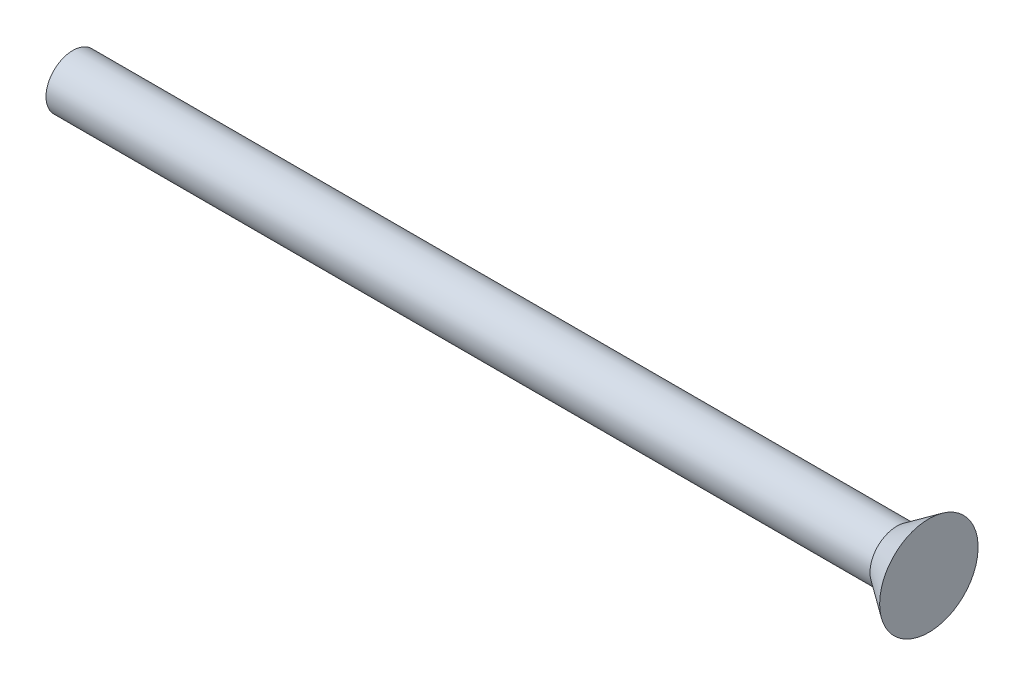
ISO-10303-21;
HEADER;
FILE_DESCRIPTION(('STEP AP214'),'2;1');
FILE_NAME('part.step','',(''),(''),'','','');
FILE_SCHEMA(('AUTOMOTIVE_DESIGN { 1 0 10303 214 1 1 1 1 }'));
ENDSEC;
DATA;
#1=APPLICATION_CONTEXT('core data for automotive mechanical design processes');
#2=APPLICATION_PROTOCOL_DEFINITION('international standard','automotive_design',2000,#1);
#3=PRODUCT_CONTEXT('',#1,'mechanical');
#4=PRODUCT('Part','Part','',(#3));
#5=PRODUCT_RELATED_PRODUCT_CATEGORY('part','',(#4));
#6=PRODUCT_DEFINITION_FORMATION('','',#4);
#7=PRODUCT_DEFINITION_CONTEXT('part definition',#1,'design');
#8=PRODUCT_DEFINITION('design','',#6,#7);
#9=PRODUCT_DEFINITION_SHAPE('','',#8);
#10=(LENGTH_UNIT() NAMED_UNIT(*) SI_UNIT(.MILLI.,.METRE.));
#11=(NAMED_UNIT(*) PLANE_ANGLE_UNIT() SI_UNIT($,.RADIAN.));
#12=(NAMED_UNIT(*) SI_UNIT($,.STERADIAN.) SOLID_ANGLE_UNIT());
#13=UNCERTAINTY_MEASURE_WITH_UNIT(LENGTH_MEASURE(1.E-05),#10,'distance_accuracy_value','');
#14=(GEOMETRIC_REPRESENTATION_CONTEXT(3) GLOBAL_UNCERTAINTY_ASSIGNED_CONTEXT((#13)) GLOBAL_UNIT_ASSIGNED_CONTEXT((#10,
#11,#12)) REPRESENTATION_CONTEXT('',''));
#15=CARTESIAN_POINT('',(0.,0.,0.));
#16=DIRECTION('',(0.,0.,1.));
#17=DIRECTION('',(1.,0.,0.));
#18=AXIS2_PLACEMENT_3D('',#15,#16,#17);
#19=CARTESIAN_POINT('',(-30.,0.,0.));
#20=DIRECTION('',(1.,0.,0.));
#21=DIRECTION('',(0.,0.,-1.));
#22=AXIS2_PLACEMENT_3D('',#19,#20,#21);
#23=PLANE('',#22);
#24=CARTESIAN_POINT('',(-30.,0.,0.));
#25=DIRECTION('',(-1.,0.,0.));
#26=DIRECTION('',(0.,0.,1.));
#27=AXIS2_PLACEMENT_3D('',#24,#25,#26);
#28=CIRCLE('',#27,1.25);
#29=CARTESIAN_POINT('',(-30.,0.,1.25));
#30=VERTEX_POINT('',#29);
#31=EDGE_CURVE('E10',#30,#30,#28,.T.);
#32=ORIENTED_EDGE('',*,*,#31,.T.);
#33=EDGE_LOOP('',(#32));
#34=FACE_BOUND('',#33,.T.);
#35=ADVANCED_FACE('F37',(#34),#23,.F.);
#36=CARTESIAN_POINT('',(-53.8440891676821,0.,0.));
#37=DIRECTION('',(-1.,0.,0.));
#38=DIRECTION('',(0.,0.,1.));
#39=AXIS2_PLACEMENT_3D('',#36,#37,#38);
#40=CYLINDRICAL_SURFACE('',#39,1.25);
#41=ORIENTED_EDGE('',*,*,#31,.F.);
#42=EDGE_LOOP('',(#41));
#43=FACE_BOUND('',#42,.T.);
#44=CARTESIAN_POINT('',(8.5,0.,0.));
#45=DIRECTION('',(-1.,0.,0.));
#46=DIRECTION('',(0.,0.,1.));
#47=AXIS2_PLACEMENT_3D('',#44,#45,#46);
#48=CIRCLE('',#47,1.25);
#49=CARTESIAN_POINT('',(8.5,0.,1.25));
#50=VERTEX_POINT('',#49);
#51=EDGE_CURVE('E43',#50,#50,#48,.T.);
#52=ORIENTED_EDGE('',*,*,#51,.T.);
#53=EDGE_LOOP('',(#52));
#54=FACE_BOUND('',#53,.T.);
#55=ADVANCED_FACE('F62',(#43,#54),#40,.T.);
#56=CARTESIAN_POINT('',(9.99999999999999,0.,0.));
#57=DIRECTION('',(1.,0.,0.));
#58=DIRECTION('',(0.,0.,-1.));
#59=AXIS2_PLACEMENT_3D('',#56,#57,#58);
#60=CONICAL_SURFACE('',#59,2.3,0.61072596438921);
#61=ORIENTED_EDGE('',*,*,#51,.F.);
#62=EDGE_LOOP('',(#61));
#63=FACE_BOUND('',#62,.T.);
#64=CARTESIAN_POINT('',(9.99999999999999,0.,0.));
#65=DIRECTION('',(-1.,0.,0.));
#66=DIRECTION('',(0.,0.,1.));
#67=AXIS2_PLACEMENT_3D('',#64,#65,#66);
#68=CIRCLE('',#67,2.3);
#69=CARTESIAN_POINT('',(9.99999999999999,0.,2.3));
#70=VERTEX_POINT('',#69);
#71=EDGE_CURVE('E47',#70,#70,#68,.T.);
#72=ORIENTED_EDGE('',*,*,#71,.T.);
#73=EDGE_LOOP('',(#72));
#74=FACE_BOUND('',#73,.T.);
#75=ADVANCED_FACE('F54',(#63,#74),#60,.T.);
#76=CARTESIAN_POINT('',(10.,2.3,0.));
#77=DIRECTION('',(-1.,0.,0.));
#78=DIRECTION('',(0.,0.,1.));
#79=AXIS2_PLACEMENT_3D('',#76,#77,#78);
#80=PLANE('',#79);
#81=ORIENTED_EDGE('',*,*,#71,.F.);
#82=EDGE_LOOP('',(#81));
#83=FACE_BOUND('',#82,.T.);
#84=ADVANCED_FACE('F56',(#83),#80,.F.);
#85=CLOSED_SHELL('',(#35,#55,#75,#84));
#86=MANIFOLD_SOLID_BREP('B2',#85);
#87=ADVANCED_BREP_SHAPE_REPRESENTATION('',(#18,#86),#14);
#88=SHAPE_DEFINITION_REPRESENTATION(#9,#87);
ENDSEC;
END-ISO-10303-21;
